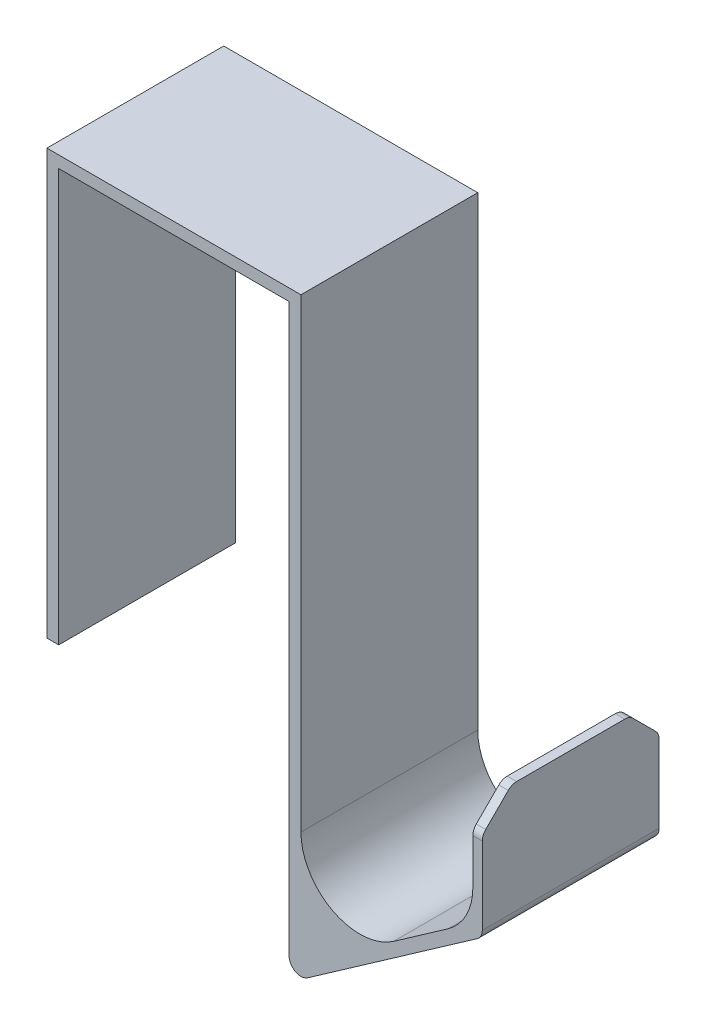
ISO-10303-21;
HEADER;
FILE_DESCRIPTION(('STEP AP214'),'2;1');
FILE_NAME('part.step','',(''),(''),'','','');
FILE_SCHEMA(('AUTOMOTIVE_DESIGN { 1 0 10303 214 1 1 1 1 }'));
ENDSEC;
DATA;
#1=APPLICATION_CONTEXT('core data for automotive mechanical design processes');
#2=APPLICATION_PROTOCOL_DEFINITION('international standard','automotive_design',2000,#1);
#3=PRODUCT_CONTEXT('',#1,'mechanical');
#4=PRODUCT('Part','Part','',(#3));
#5=PRODUCT_RELATED_PRODUCT_CATEGORY('part','',(#4));
#6=PRODUCT_DEFINITION_FORMATION('','',#4);
#7=PRODUCT_DEFINITION_CONTEXT('part definition',#1,'design');
#8=PRODUCT_DEFINITION('design','',#6,#7);
#9=PRODUCT_DEFINITION_SHAPE('','',#8);
#10=(LENGTH_UNIT() NAMED_UNIT(*) SI_UNIT(.MILLI.,.METRE.));
#11=(NAMED_UNIT(*) PLANE_ANGLE_UNIT() SI_UNIT($,.RADIAN.));
#12=(NAMED_UNIT(*) SI_UNIT($,.STERADIAN.) SOLID_ANGLE_UNIT());
#13=UNCERTAINTY_MEASURE_WITH_UNIT(LENGTH_MEASURE(1.E-05),#10,'distance_accuracy_value','');
#14=(GEOMETRIC_REPRESENTATION_CONTEXT(3) GLOBAL_UNCERTAINTY_ASSIGNED_CONTEXT((#13)) GLOBAL_UNIT_ASSIGNED_CONTEXT((#10,
#11,#12)) REPRESENTATION_CONTEXT('',''));
#15=CARTESIAN_POINT('',(0.,0.,0.));
#16=DIRECTION('',(0.,0.,1.));
#17=DIRECTION('',(1.,0.,0.));
#18=AXIS2_PLACEMENT_3D('',#15,#16,#17);
#19=CARTESIAN_POINT('',(-21.55,43.689057372,30.));
#20=DIRECTION('',(0.,1.,0.));
#21=DIRECTION('',(-1.,0.,0.));
#22=AXIS2_PLACEMENT_3D('',#19,#20,#21);
#23=PLANE('',#22);
#24=DIRECTION('',(1.,0.,0.));
#25=VECTOR('',#24,1.);
#26=CARTESIAN_POINT('',(-21.55,43.689057372,0.));
#27=LINE('',#26,#25);
#28=CARTESIAN_POINT('',(-21.55,43.689057372,0.));
#29=VERTEX_POINT('',#28);
#30=CARTESIAN_POINT('',(-19.55,43.689057372,0.));
#31=VERTEX_POINT('',#30);
#32=EDGE_CURVE('E207',#29,#31,#27,.T.);
#33=ORIENTED_EDGE('',*,*,#32,.T.);
#34=DIRECTION('',(0.,0.,-1.));
#35=VECTOR('',#34,1.);
#36=CARTESIAN_POINT('',(-19.55,43.689057372,30.));
#37=LINE('',#36,#35);
#38=CARTESIAN_POINT('',(-19.55,43.689057372,30.));
#39=VERTEX_POINT('',#38);
#40=EDGE_CURVE('E187',#39,#31,#37,.T.);
#41=ORIENTED_EDGE('',*,*,#40,.F.);
#42=DIRECTION('',(1.,0.,0.));
#43=VECTOR('',#42,1.);
#44=CARTESIAN_POINT('',(-21.55,43.689057372,30.));
#45=LINE('',#44,#43);
#46=CARTESIAN_POINT('',(-21.55,43.689057372,30.));
#47=VERTEX_POINT('',#46);
#48=EDGE_CURVE('E194',#47,#39,#45,.T.);
#49=ORIENTED_EDGE('',*,*,#48,.F.);
#50=DIRECTION('',(0.,0.,-1.));
#51=VECTOR('',#50,1.);
#52=CARTESIAN_POINT('',(-21.55,43.689057372,30.));
#53=LINE('',#52,#51);
#54=EDGE_CURVE('E332',#47,#29,#53,.T.);
#55=ORIENTED_EDGE('',*,*,#54,.T.);
#56=EDGE_LOOP('',(#33,#41,#49,#55));
#57=FACE_BOUND('',#56,.T.);
#58=ADVANCED_FACE('F35',(#57),#23,.F.);
#59=CARTESIAN_POINT('',(-19.55,43.689057372,30.));
#60=DIRECTION('',(-1.,0.,0.));
#61=DIRECTION('',(0.,0.,1.));
#62=AXIS2_PLACEMENT_3D('',#59,#60,#61);
#63=PLANE('',#62);
#64=DIRECTION('',(0.,1.,0.));
#65=VECTOR('',#64,1.);
#66=CARTESIAN_POINT('',(-19.55,43.689057372,0.));
#67=LINE('',#66,#65);
#68=CARTESIAN_POINT('',(-19.55,113.689057372,0.));
#69=VERTEX_POINT('',#68);
#70=EDGE_CURVE('E354',#31,#69,#67,.T.);
#71=ORIENTED_EDGE('',*,*,#70,.T.);
#72=DIRECTION('',(0.,0.,-1.));
#73=VECTOR('',#72,1.);
#74=CARTESIAN_POINT('',(-19.55,113.689057372,30.));
#75=LINE('',#74,#73);
#76=CARTESIAN_POINT('',(-19.55,113.689057372,30.));
#77=VERTEX_POINT('',#76);
#78=EDGE_CURVE('E190',#77,#69,#75,.T.);
#79=ORIENTED_EDGE('',*,*,#78,.F.);
#80=DIRECTION('',(0.,1.,0.));
#81=VECTOR('',#80,1.);
#82=CARTESIAN_POINT('',(-19.55,43.689057372,30.));
#83=LINE('',#82,#81);
#84=EDGE_CURVE('E183',#39,#77,#83,.T.);
#85=ORIENTED_EDGE('',*,*,#84,.F.);
#86=ORIENTED_EDGE('',*,*,#40,.T.);
#87=EDGE_LOOP('',(#71,#79,#85,#86));
#88=FACE_BOUND('',#87,.T.);
#89=ADVANCED_FACE('F185',(#88),#63,.F.);
#90=CARTESIAN_POINT('',(-19.55,113.689057372,30.));
#91=DIRECTION('',(0.,1.,0.));
#92=DIRECTION('',(0.,0.,1.));
#93=AXIS2_PLACEMENT_3D('',#90,#91,#92);
#94=PLANE('',#93);
#95=DIRECTION('',(1.,0.,0.));
#96=VECTOR('',#95,1.);
#97=CARTESIAN_POINT('',(-19.55,113.689057372,0.));
#98=LINE('',#97,#96);
#99=CARTESIAN_POINT('',(19.55,113.689057372,0.));
#100=VERTEX_POINT('',#99);
#101=EDGE_CURVE('E353',#69,#100,#98,.T.);
#102=ORIENTED_EDGE('',*,*,#101,.T.);
#103=DIRECTION('',(0.,0.,-1.));
#104=VECTOR('',#103,1.);
#105=CARTESIAN_POINT('',(19.55,113.689057372,30.));
#106=LINE('',#105,#104);
#107=CARTESIAN_POINT('',(19.55,113.689057372,30.));
#108=VERTEX_POINT('',#107);
#109=EDGE_CURVE('E212',#108,#100,#106,.T.);
#110=ORIENTED_EDGE('',*,*,#109,.F.);
#111=DIRECTION('',(1.,0.,0.));
#112=VECTOR('',#111,1.);
#113=CARTESIAN_POINT('',(-19.55,113.689057372,30.));
#114=LINE('',#113,#112);
#115=EDGE_CURVE('E193',#77,#108,#114,.T.);
#116=ORIENTED_EDGE('',*,*,#115,.F.);
#117=ORIENTED_EDGE('',*,*,#78,.T.);
#118=EDGE_LOOP('',(#102,#110,#116,#117));
#119=FACE_BOUND('',#118,.T.);
#120=ADVANCED_FACE('F371',(#119),#94,.F.);
#121=CARTESIAN_POINT('',(19.55,113.689057372,30.));
#122=DIRECTION('',(1.,0.,0.));
#123=DIRECTION('',(0.,0.,-1.));
#124=AXIS2_PLACEMENT_3D('',#121,#122,#123);
#125=PLANE('',#124);
#126=DIRECTION('',(0.,-1.,0.));
#127=VECTOR('',#126,1.);
#128=CARTESIAN_POINT('',(19.55,113.689057372,0.));
#129=LINE('',#128,#127);
#130=CARTESIAN_POINT('',(19.55,17.5310216259423,0.));
#131=VERTEX_POINT('',#130);
#132=EDGE_CURVE('E321',#100,#131,#129,.T.);
#133=ORIENTED_EDGE('',*,*,#132,.T.);
#134=DIRECTION('',(0.,0.,-1.));
#135=VECTOR('',#134,1.);
#136=CARTESIAN_POINT('',(19.55,17.5310216259423,30.));
#137=LINE('',#136,#135);
#138=CARTESIAN_POINT('',(19.55,17.5310216259423,30.));
#139=VERTEX_POINT('',#138);
#140=EDGE_CURVE('E11',#131,#139,#137,.F.);
#141=ORIENTED_EDGE('',*,*,#140,.T.);
#142=DIRECTION('',(0.,-1.,0.));
#143=VECTOR('',#142,1.);
#144=CARTESIAN_POINT('',(19.55,113.689057372,30.));
#145=LINE('',#144,#143);
#146=EDGE_CURVE('E306',#108,#139,#145,.T.);
#147=ORIENTED_EDGE('',*,*,#146,.F.);
#148=ORIENTED_EDGE('',*,*,#109,.T.);
#149=EDGE_LOOP('',(#133,#141,#147,#148));
#150=FACE_BOUND('',#149,.T.);
#151=ADVANCED_FACE('F349',(#150),#125,.F.);
#152=CARTESIAN_POINT('',(19.55,13.689057372,30.));
#153=DIRECTION('',(-0.57357643635105,0.819152044288989,0.));
#154=DIRECTION('',(-0.819152044288989,-0.57357643635105,0.));
#155=AXIS2_PLACEMENT_3D('',#152,#153,#154);
#156=PLANE('',#155);
#157=DIRECTION('',(0.819152044288989,0.57357643635105,0.));
#158=VECTOR('',#157,1.);
#159=CARTESIAN_POINT('',(19.55,13.689057372,0.));
#160=LINE('',#159,#158);
#161=CARTESIAN_POINT('',(22.6971528727021,15.8927175373644,0.));
#162=VERTEX_POINT('',#161);
#163=CARTESIAN_POINT('',(51.4632346442617,36.0349448385675,0.));
#164=VERTEX_POINT('',#163);
#165=EDGE_CURVE('E299',#162,#164,#160,.T.);
#166=ORIENTED_EDGE('',*,*,#165,.T.);
#167=DIRECTION('',(0.,0.,-1.));
#168=VECTOR('',#167,1.);
#169=CARTESIAN_POINT('',(51.4632346442617,36.0349448385675,30.));
#170=LINE('',#169,#168);
#171=CARTESIAN_POINT('',(51.4632346442617,36.0349448385675,30.));
#172=VERTEX_POINT('',#171);
#173=EDGE_CURVE('E43',#164,#172,#170,.F.);
#174=ORIENTED_EDGE('',*,*,#173,.T.);
#175=DIRECTION('',(0.819152044288989,0.57357643635105,0.));
#176=VECTOR('',#175,1.);
#177=CARTESIAN_POINT('',(19.55,13.689057372,30.));
#178=LINE('',#177,#176);
#179=CARTESIAN_POINT('',(22.6971528727021,15.8927175373644,30.));
#180=VERTEX_POINT('',#179);
#181=EDGE_CURVE('E297',#180,#172,#178,.T.);
#182=ORIENTED_EDGE('',*,*,#181,.F.);
#183=DIRECTION('',(0.,0.,-1.));
#184=VECTOR('',#183,1.);
#185=CARTESIAN_POINT('',(22.6971528727021,15.8927175373644,30.));
#186=LINE('',#185,#184);
#187=EDGE_CURVE('E290',#180,#162,#186,.T.);
#188=ORIENTED_EDGE('',*,*,#187,.T.);
#189=EDGE_LOOP('',(#166,#174,#182,#188));
#190=FACE_BOUND('',#189,.T.);
#191=ADVANCED_FACE('F296',(#190),#156,.F.);
#192=CARTESIAN_POINT('',(52.3160817715596,36.632114826042,30.));
#193=DIRECTION('',(-1.,0.,0.));
#194=DIRECTION('',(0.,0.,1.));
#195=AXIS2_PLACEMENT_3D('',#192,#193,#194);
#196=PLANE('',#195);
#197=DIRECTION('',(0.,-0.707106781186546,0.707106781186549));
#198=VECTOR('',#197,1.);
#199=CARTESIAN_POINT('',(52.3160817715596,51.632114826042,30.));
#200=LINE('',#199,#198);
#201=CARTESIAN_POINT('',(52.3160817715596,56.0463283884151,25.5857864376269));
#202=VERTEX_POINT('',#201);
#203=CARTESIAN_POINT('',(52.3160817715596,52.2179012636689,29.4142135623731));
#204=VERTEX_POINT('',#203);
#205=EDGE_CURVE('E239',#202,#204,#200,.T.);
#206=ORIENTED_EDGE('',*,*,#205,.T.);
#207=CARTESIAN_POINT('',(52.3160817715596,50.8036877012958,28.));
#208=DIRECTION('',(-1.,0.,0.));
#209=DIRECTION('',(0.,0.,1.));
#210=AXIS2_PLACEMENT_3D('',#207,#208,#209);
#211=CIRCLE('',#210,2.);
#212=CARTESIAN_POINT('',(52.3160817715596,50.8036877012958,30.));
#213=VERTEX_POINT('',#212);
#214=EDGE_CURVE('E273',#204,#213,#211,.F.);
#215=ORIENTED_EDGE('',*,*,#214,.T.);
#216=DIRECTION('',(0.,1.,0.));
#217=VECTOR('',#216,1.);
#218=CARTESIAN_POINT('',(52.3160817715596,36.632114826042,30.));
#219=LINE('',#218,#217);
#220=CARTESIAN_POINT('',(52.3160817715596,37.6732489271455,30.));
#221=VERTEX_POINT('',#220);
#222=EDGE_CURVE('E305',#221,#213,#219,.T.);
#223=ORIENTED_EDGE('',*,*,#222,.F.);
#224=DIRECTION('',(0.,0.,-1.));
#225=VECTOR('',#224,1.);
#226=CARTESIAN_POINT('',(52.3160817715596,37.6732489271455,30.));
#227=LINE('',#226,#225);
#228=CARTESIAN_POINT('',(52.3160817715596,37.6732489271455,0.));
#229=VERTEX_POINT('',#228);
#230=EDGE_CURVE('E264',#221,#229,#227,.T.);
#231=ORIENTED_EDGE('',*,*,#230,.T.);
#232=DIRECTION('',(0.,1.,0.));
#233=VECTOR('',#232,1.);
#234=CARTESIAN_POINT('',(52.3160817715596,36.632114826042,0.));
#235=LINE('',#234,#233);
#236=CARTESIAN_POINT('',(52.3160817715596,50.8036877012958,0.));
#237=VERTEX_POINT('',#236);
#238=EDGE_CURVE('E313',#229,#237,#235,.T.);
#239=ORIENTED_EDGE('',*,*,#238,.T.);
#240=CARTESIAN_POINT('',(52.3160817715596,50.8036877012958,2.));
#241=DIRECTION('',(-1.,0.,0.));
#242=DIRECTION('',(0.,0.,1.));
#243=AXIS2_PLACEMENT_3D('',#240,#241,#242);
#244=CIRCLE('',#243,2.);
#245=CARTESIAN_POINT('',(52.3160817715596,52.2179012636689,0.5857864376269));
#246=VERTEX_POINT('',#245);
#247=EDGE_CURVE('E271',#237,#246,#244,.F.);
#248=ORIENTED_EDGE('',*,*,#247,.T.);
#249=DIRECTION('',(0.,-0.70710678118655,-0.707106781186545));
#250=VECTOR('',#249,1.);
#251=CARTESIAN_POINT('',(52.3160817715596,56.632114826042,4.99999999999996));
#252=LINE('',#251,#250);
#253=CARTESIAN_POINT('',(52.3160817715596,56.0463283884151,4.41421356237306));
#254=VERTEX_POINT('',#253);
#255=EDGE_CURVE('E242',#246,#254,#252,.F.);
#256=ORIENTED_EDGE('',*,*,#255,.T.);
#257=CARTESIAN_POINT('',(52.3160817715596,54.632114826042,5.82842712474615));
#258=DIRECTION('',(-1.,0.,0.));
#259=DIRECTION('',(0.,0.,1.));
#260=AXIS2_PLACEMENT_3D('',#257,#258,#259);
#261=CIRCLE('',#260,2.);
#262=CARTESIAN_POINT('',(52.3160817715596,56.632114826042,5.82842712474615));
#263=VERTEX_POINT('',#262);
#264=EDGE_CURVE('E269',#254,#263,#261,.F.);
#265=ORIENTED_EDGE('',*,*,#264,.T.);
#266=DIRECTION('',(0.,0.,-1.));
#267=VECTOR('',#266,1.);
#268=CARTESIAN_POINT('',(52.3160817715596,56.632114826042,30.));
#269=LINE('',#268,#267);
#270=CARTESIAN_POINT('',(52.3160817715596,56.632114826042,24.1715728752538));
#271=VERTEX_POINT('',#270);
#272=EDGE_CURVE('E343',#271,#263,#269,.T.);
#273=ORIENTED_EDGE('',*,*,#272,.F.);
#274=CARTESIAN_POINT('',(52.3160817715596,54.632114826042,24.1715728752538));
#275=DIRECTION('',(-1.,0.,0.));
#276=DIRECTION('',(0.,0.,1.));
#277=AXIS2_PLACEMENT_3D('',#274,#275,#276);
#278=CIRCLE('',#277,2.);
#279=EDGE_CURVE('E267',#271,#202,#278,.F.);
#280=ORIENTED_EDGE('',*,*,#279,.T.);
#281=EDGE_LOOP('',(#206,#215,#223,#231,#239,#248,#256,#265,#273,#280));
#282=FACE_BOUND('',#281,.T.);
#283=ADVANCED_FACE('F312',(#282),#196,.F.);
#284=CARTESIAN_POINT('',(50.7160817715596,56.632114826042,30.));
#285=DIRECTION('',(0.,-1.,0.));
#286=DIRECTION('',(0.,0.,-1.));
#287=AXIS2_PLACEMENT_3D('',#284,#285,#286);
#288=PLANE('',#287);
#289=ORIENTED_EDGE('',*,*,#272,.T.);
#290=DIRECTION('',(1.,0.,0.));
#291=VECTOR('',#290,1.);
#292=CARTESIAN_POINT('',(50.7160817715596,56.632114826042,5.82842712474615));
#293=LINE('',#292,#291);
#294=CARTESIAN_POINT('',(50.7160817715596,56.632114826042,5.82842712474615));
#295=VERTEX_POINT('',#294);
#296=EDGE_CURVE('E287',#263,#295,#293,.F.);
#297=ORIENTED_EDGE('',*,*,#296,.T.);
#298=DIRECTION('',(0.,0.,-1.));
#299=VECTOR('',#298,1.);
#300=CARTESIAN_POINT('',(50.7160817715596,56.632114826042,30.));
#301=LINE('',#300,#299);
#302=CARTESIAN_POINT('',(50.7160817715596,56.632114826042,24.1715728752538));
#303=VERTEX_POINT('',#302);
#304=EDGE_CURVE('E340',#303,#295,#301,.T.);
#305=ORIENTED_EDGE('',*,*,#304,.F.);
#306=DIRECTION('',(1.,0.,0.));
#307=VECTOR('',#306,1.);
#308=CARTESIAN_POINT('',(52.3160817715596,56.632114826042,24.1715728752538));
#309=LINE('',#308,#307);
#310=EDGE_CURVE('E284',#303,#271,#309,.T.);
#311=ORIENTED_EDGE('',*,*,#310,.T.);
#312=EDGE_LOOP('',(#289,#297,#305,#311));
#313=FACE_BOUND('',#312,.T.);
#314=ADVANCED_FACE('F501',(#313),#288,.F.);
#315=CARTESIAN_POINT('',(50.7160817715596,37.9533319424294,30.));
#316=DIRECTION('',(1.,0.,0.));
#317=DIRECTION('',(0.,0.,-1.));
#318=AXIS2_PLACEMENT_3D('',#315,#316,#317);
#319=PLANE('',#318);
#320=DIRECTION('',(0.,-1.,0.));
#321=VECTOR('',#320,1.);
#322=CARTESIAN_POINT('',(50.7160817715596,37.9533319424294,30.));
#323=LINE('',#322,#321);
#324=CARTESIAN_POINT('',(50.7160817715596,50.8036877012958,30.));
#325=VERTEX_POINT('',#324);
#326=CARTESIAN_POINT('',(50.7160817715596,43.1590024479468,30.));
#327=VERTEX_POINT('',#326);
#328=EDGE_CURVE('E367',#325,#327,#323,.T.);
#329=ORIENTED_EDGE('',*,*,#328,.F.);
#330=CARTESIAN_POINT('',(50.7160817715596,50.8036877012958,28.));
#331=DIRECTION('',(1.,0.,0.));
#332=DIRECTION('',(0.,0.,-1.));
#333=AXIS2_PLACEMENT_3D('',#330,#331,#332);
#334=CIRCLE('',#333,2.);
#335=CARTESIAN_POINT('',(50.7160817715596,52.2179012636689,29.4142135623731));
#336=VERTEX_POINT('',#335);
#337=EDGE_CURVE('E258',#325,#336,#334,.F.);
#338=ORIENTED_EDGE('',*,*,#337,.T.);
#339=DIRECTION('',(0.,0.707106781186546,-0.707106781186549));
#340=VECTOR('',#339,1.);
#341=CARTESIAN_POINT('',(50.7160817715596,51.632114826042,30.));
#342=LINE('',#341,#340);
#343=CARTESIAN_POINT('',(50.7160817715596,56.0463283884151,25.5857864376269));
#344=VERTEX_POINT('',#343);
#345=EDGE_CURVE('E233',#336,#344,#342,.T.);
#346=ORIENTED_EDGE('',*,*,#345,.T.);
#347=CARTESIAN_POINT('',(50.7160817715596,54.632114826042,24.1715728752538));
#348=DIRECTION('',(1.,0.,0.));
#349=DIRECTION('',(0.,0.,-1.));
#350=AXIS2_PLACEMENT_3D('',#347,#348,#349);
#351=CIRCLE('',#350,2.);
#352=EDGE_CURVE('E252',#344,#303,#351,.F.);
#353=ORIENTED_EDGE('',*,*,#352,.T.);
#354=ORIENTED_EDGE('',*,*,#304,.T.);
#355=CARTESIAN_POINT('',(50.7160817715596,54.632114826042,5.82842712474615));
#356=DIRECTION('',(1.,0.,0.));
#357=DIRECTION('',(0.,0.,-1.));
#358=AXIS2_PLACEMENT_3D('',#355,#356,#357);
#359=CIRCLE('',#358,2.);
#360=CARTESIAN_POINT('',(50.7160817715596,56.0463283884151,4.41421356237306));
#361=VERTEX_POINT('',#360);
#362=EDGE_CURVE('E254',#295,#361,#359,.F.);
#363=ORIENTED_EDGE('',*,*,#362,.T.);
#364=DIRECTION('',(0.,0.70710678118655,0.707106781186545));
#365=VECTOR('',#364,1.);
#366=CARTESIAN_POINT('',(50.7160817715596,56.632114826042,4.99999999999996));
#367=LINE('',#366,#365);
#368=CARTESIAN_POINT('',(50.7160817715596,52.2179012636689,0.5857864376269));
#369=VERTEX_POINT('',#368);
#370=EDGE_CURVE('E236',#361,#369,#367,.F.);
#371=ORIENTED_EDGE('',*,*,#370,.T.);
#372=CARTESIAN_POINT('',(50.7160817715596,50.8036877012958,2.));
#373=DIRECTION('',(1.,0.,0.));
#374=DIRECTION('',(0.,0.,-1.));
#375=AXIS2_PLACEMENT_3D('',#372,#373,#374);
#376=CIRCLE('',#375,2.);
#377=CARTESIAN_POINT('',(50.7160817715596,50.8036877012958,0.));
#378=VERTEX_POINT('',#377);
#379=EDGE_CURVE('E256',#369,#378,#376,.F.);
#380=ORIENTED_EDGE('',*,*,#379,.T.);
#381=DIRECTION('',(0.,-1.,0.));
#382=VECTOR('',#381,1.);
#383=CARTESIAN_POINT('',(50.7160817715596,37.9533319424294,0.));
#384=LINE('',#383,#382);
#385=CARTESIAN_POINT('',(50.7160817715596,43.1590024479468,0.));
#386=VERTEX_POINT('',#385);
#387=EDGE_CURVE('E317',#378,#386,#384,.T.);
#388=ORIENTED_EDGE('',*,*,#387,.T.);
#389=DIRECTION('',(0.,0.,-1.));
#390=VECTOR('',#389,1.);
#391=CARTESIAN_POINT('',(50.7160817715596,43.1590024479468,30.));
#392=LINE('',#391,#390);
#393=EDGE_CURVE('E218',#386,#327,#392,.F.);
#394=ORIENTED_EDGE('',*,*,#393,.T.);
#395=EDGE_LOOP('',(#329,#338,#346,#353,#354,#363,#371,#380,#388,#394));
#396=FACE_BOUND('',#395,.T.);
#397=ADVANCED_FACE('F495',(#396),#319,.F.);
#398=CARTESIAN_POINT('',(21.55,17.5310216259423,30.));
#399=DIRECTION('',(0.57357643635105,-0.819152044288989,0.));
#400=DIRECTION('',(0.819152044288989,0.57357643635105,0.));
#401=AXIS2_PLACEMENT_3D('',#398,#399,#400);
#402=PLANE('',#401);
#403=DIRECTION('',(-0.819152044288989,-0.57357643635105,0.));
#404=VECTOR('',#403,1.);
#405=CARTESIAN_POINT('',(21.55,17.5310216259423,30.));
#406=LINE('',#405,#404);
#407=CARTESIAN_POINT('',(46.4518461350701,34.9674820050569,30.));
#408=VERTEX_POINT('',#407);
#409=CARTESIAN_POINT('',(37.2857643635105,28.5493224527642,30.));
#410=VERTEX_POINT('',#409);
#411=EDGE_CURVE('E364',#408,#410,#406,.T.);
#412=ORIENTED_EDGE('',*,*,#411,.F.);
#413=DIRECTION('',(0.,0.,-1.));
#414=VECTOR('',#413,1.);
#415=CARTESIAN_POINT('',(46.4518461350701,34.9674820050569,0.));
#416=LINE('',#415,#414);
#417=CARTESIAN_POINT('',(46.4518461350701,34.9674820050569,0.));
#418=VERTEX_POINT('',#417);
#419=EDGE_CURVE('E210',#408,#418,#416,.T.);
#420=ORIENTED_EDGE('',*,*,#419,.T.);
#421=DIRECTION('',(-0.819152044288989,-0.57357643635105,0.));
#422=VECTOR('',#421,1.);
#423=CARTESIAN_POINT('',(21.55,17.5310216259423,0.));
#424=LINE('',#423,#422);
#425=CARTESIAN_POINT('',(37.2857643635105,28.5493224527642,0.));
#426=VERTEX_POINT('',#425);
#427=EDGE_CURVE('E319',#418,#426,#424,.T.);
#428=ORIENTED_EDGE('',*,*,#427,.T.);
#429=DIRECTION('',(0.,0.,-1.));
#430=VECTOR('',#429,1.);
#431=CARTESIAN_POINT('',(37.2857643635105,28.5493224527642,30.));
#432=LINE('',#431,#430);
#433=EDGE_CURVE('E208',#426,#410,#432,.F.);
#434=ORIENTED_EDGE('',*,*,#433,.T.);
#435=EDGE_LOOP('',(#412,#420,#428,#434));
#436=FACE_BOUND('',#435,.T.);
#437=ADVANCED_FACE('F500',(#436),#402,.F.);
#438=CARTESIAN_POINT('',(21.55,115.689057372,30.));
#439=DIRECTION('',(-1.,0.,0.));
#440=DIRECTION('',(0.,-1.,0.));
#441=AXIS2_PLACEMENT_3D('',#438,#439,#440);
#442=PLANE('',#441);
#443=DIRECTION('',(0.,1.,0.));
#444=VECTOR('',#443,1.);
#445=CARTESIAN_POINT('',(21.55,115.689057372,30.));
#446=LINE('',#445,#444);
#447=CARTESIAN_POINT('',(21.55,36.7408428956541,30.));
#448=VERTEX_POINT('',#447);
#449=CARTESIAN_POINT('',(21.55,115.689057372,30.));
#450=VERTEX_POINT('',#449);
#451=EDGE_CURVE('E362',#448,#450,#446,.T.);
#452=ORIENTED_EDGE('',*,*,#451,.F.);
#453=DIRECTION('',(0.,0.,-1.));
#454=VECTOR('',#453,1.);
#455=CARTESIAN_POINT('',(21.55,36.7408428956541,0.));
#456=LINE('',#455,#454);
#457=CARTESIAN_POINT('',(21.55,36.7408428956541,0.));
#458=VERTEX_POINT('',#457);
#459=EDGE_CURVE('E221',#448,#458,#456,.T.);
#460=ORIENTED_EDGE('',*,*,#459,.T.);
#461=DIRECTION('',(0.,1.,0.));
#462=VECTOR('',#461,1.);
#463=CARTESIAN_POINT('',(21.55,115.689057372,0.));
#464=LINE('',#463,#462);
#465=CARTESIAN_POINT('',(21.55,115.689057372,0.));
#466=VERTEX_POINT('',#465);
#467=EDGE_CURVE('E327',#458,#466,#464,.T.);
#468=ORIENTED_EDGE('',*,*,#467,.T.);
#469=DIRECTION('',(0.,0.,-1.));
#470=VECTOR('',#469,1.);
#471=CARTESIAN_POINT('',(21.55,115.689057372,30.));
#472=LINE('',#471,#470);
#473=EDGE_CURVE('E337',#450,#466,#472,.T.);
#474=ORIENTED_EDGE('',*,*,#473,.F.);
#475=EDGE_LOOP('',(#452,#460,#468,#474));
#476=FACE_BOUND('',#475,.T.);
#477=ADVANCED_FACE('F551',(#476),#442,.F.);
#478=CARTESIAN_POINT('',(-21.55,115.689057372,30.));
#479=DIRECTION('',(0.,-1.,0.));
#480=DIRECTION('',(1.,0.,0.));
#481=AXIS2_PLACEMENT_3D('',#478,#479,#480);
#482=PLANE('',#481);
#483=DIRECTION('',(-1.,0.,0.));
#484=VECTOR('',#483,1.);
#485=CARTESIAN_POINT('',(-21.55,115.689057372,0.));
#486=LINE('',#485,#484);
#487=CARTESIAN_POINT('',(-21.55,115.689057372,0.));
#488=VERTEX_POINT('',#487);
#489=EDGE_CURVE('E329',#466,#488,#486,.T.);
#490=ORIENTED_EDGE('',*,*,#489,.T.);
#491=DIRECTION('',(0.,0.,-1.));
#492=VECTOR('',#491,1.);
#493=CARTESIAN_POINT('',(-21.55,115.689057372,30.));
#494=LINE('',#493,#492);
#495=CARTESIAN_POINT('',(-21.55,115.689057372,30.));
#496=VERTEX_POINT('',#495);
#497=EDGE_CURVE('E334',#496,#488,#494,.T.);
#498=ORIENTED_EDGE('',*,*,#497,.F.);
#499=DIRECTION('',(-1.,0.,0.));
#500=VECTOR('',#499,1.);
#501=CARTESIAN_POINT('',(-21.55,115.689057372,30.));
#502=LINE('',#501,#500);
#503=EDGE_CURVE('E360',#450,#496,#502,.T.);
#504=ORIENTED_EDGE('',*,*,#503,.F.);
#505=ORIENTED_EDGE('',*,*,#473,.T.);
#506=EDGE_LOOP('',(#490,#498,#504,#505));
#507=FACE_BOUND('',#506,.T.);
#508=ADVANCED_FACE('F556',(#507),#482,.F.);
#509=CARTESIAN_POINT('',(-21.55,43.689057372,30.));
#510=DIRECTION('',(1.,0.,0.));
#511=DIRECTION('',(0.,0.,-1.));
#512=AXIS2_PLACEMENT_3D('',#509,#510,#511);
#513=PLANE('',#512);
#514=DIRECTION('',(0.,-1.,0.));
#515=VECTOR('',#514,1.);
#516=CARTESIAN_POINT('',(-21.55,43.689057372,0.));
#517=LINE('',#516,#515);
#518=EDGE_CURVE('E204',#488,#29,#517,.T.);
#519=ORIENTED_EDGE('',*,*,#518,.T.);
#520=ORIENTED_EDGE('',*,*,#54,.F.);
#521=DIRECTION('',(0.,-1.,0.));
#522=VECTOR('',#521,1.);
#523=CARTESIAN_POINT('',(-21.55,43.689057372,30.));
#524=LINE('',#523,#522);
#525=EDGE_CURVE('E200',#496,#47,#524,.T.);
#526=ORIENTED_EDGE('',*,*,#525,.F.);
#527=ORIENTED_EDGE('',*,*,#497,.T.);
#528=EDGE_LOOP('',(#519,#520,#526,#527));
#529=FACE_BOUND('',#528,.T.);
#530=ADVANCED_FACE('F488',(#529),#513,.F.);
#531=CARTESIAN_POINT('',(0.,0.,30.));
#532=DIRECTION('',(0.,0.,1.));
#533=DIRECTION('',(1.,0.,0.));
#534=AXIS2_PLACEMENT_3D('',#531,#532,#533);
#535=PLANE('',#534);
#536=ORIENTED_EDGE('',*,*,#222,.T.);
#537=DIRECTION('',(-1.,0.,0.));
#538=VECTOR('',#537,1.);
#539=CARTESIAN_POINT('',(0.,50.8036877012958,30.));
#540=LINE('',#539,#538);
#541=EDGE_CURVE('E249',#213,#325,#540,.T.);
#542=ORIENTED_EDGE('',*,*,#541,.T.);
#543=ORIENTED_EDGE('',*,*,#328,.T.);
#544=CARTESIAN_POINT('',(40.7160817715596,43.1590024479468,30.));
#545=DIRECTION('',(0.,0.,1.));
#546=DIRECTION('',(1.,0.,0.));
#547=AXIS2_PLACEMENT_3D('',#544,#545,#546);
#548=CIRCLE('',#547,10.);
#549=EDGE_CURVE('E227',#327,#408,#548,.F.);
#550=ORIENTED_EDGE('',*,*,#549,.T.);
#551=ORIENTED_EDGE('',*,*,#411,.T.);
#552=CARTESIAN_POINT('',(31.55,36.7408428956541,30.));
#553=DIRECTION('',(0.,0.,1.));
#554=DIRECTION('',(1.,0.,0.));
#555=AXIS2_PLACEMENT_3D('',#552,#553,#554);
#556=CIRCLE('',#555,10.);
#557=EDGE_CURVE('E231',#410,#448,#556,.F.);
#558=ORIENTED_EDGE('',*,*,#557,.T.);
#559=ORIENTED_EDGE('',*,*,#451,.T.);
#560=ORIENTED_EDGE('',*,*,#503,.T.);
#561=ORIENTED_EDGE('',*,*,#525,.T.);
#562=ORIENTED_EDGE('',*,*,#48,.T.);
#563=ORIENTED_EDGE('',*,*,#84,.T.);
#564=ORIENTED_EDGE('',*,*,#115,.T.);
#565=ORIENTED_EDGE('',*,*,#146,.T.);
#566=CARTESIAN_POINT('',(21.55,17.5310216259423,30.));
#567=DIRECTION('',(0.,0.,1.));
#568=DIRECTION('',(1.,0.,0.));
#569=AXIS2_PLACEMENT_3D('',#566,#567,#568);
#570=CIRCLE('',#569,2.);
#571=EDGE_CURVE('E245',#139,#180,#570,.T.);
#572=ORIENTED_EDGE('',*,*,#571,.T.);
#573=ORIENTED_EDGE('',*,*,#181,.T.);
#574=CARTESIAN_POINT('',(50.3160817715596,37.6732489271455,30.));
#575=DIRECTION('',(0.,0.,1.));
#576=DIRECTION('',(1.,0.,0.));
#577=AXIS2_PLACEMENT_3D('',#574,#575,#576);
#578=CIRCLE('',#577,2.);
#579=EDGE_CURVE('E247',#172,#221,#578,.T.);
#580=ORIENTED_EDGE('',*,*,#579,.T.);
#581=EDGE_LOOP('',(#536,#542,#543,#550,#551,#558,#559,#560,#561,#562,#563,#564,#565,#572,#573,#580));
#582=FACE_BOUND('',#581,.T.);
#583=ADVANCED_FACE('F198',(#582),#535,.T.);
#584=CARTESIAN_POINT('',(0.,0.,0.));
#585=DIRECTION('',(0.,0.,1.));
#586=DIRECTION('',(1.,0.,0.));
#587=AXIS2_PLACEMENT_3D('',#584,#585,#586);
#588=PLANE('',#587);
#589=ORIENTED_EDGE('',*,*,#387,.F.);
#590=DIRECTION('',(-1.,0.,0.));
#591=VECTOR('',#590,1.);
#592=CARTESIAN_POINT('',(52.3160817715596,50.8036877012958,0.));
#593=LINE('',#592,#591);
#594=EDGE_CURVE('E277',#378,#237,#593,.F.);
#595=ORIENTED_EDGE('',*,*,#594,.T.);
#596=ORIENTED_EDGE('',*,*,#238,.F.);
#597=CARTESIAN_POINT('',(50.3160817715596,37.6732489271455,0.));
#598=DIRECTION('',(0.,0.,1.));
#599=DIRECTION('',(1.,0.,0.));
#600=AXIS2_PLACEMENT_3D('',#597,#598,#599);
#601=CIRCLE('',#600,2.);
#602=EDGE_CURVE('E56',#229,#164,#601,.F.);
#603=ORIENTED_EDGE('',*,*,#602,.T.);
#604=ORIENTED_EDGE('',*,*,#165,.F.);
#605=CARTESIAN_POINT('',(21.55,17.5310216259423,0.));
#606=DIRECTION('',(0.,0.,1.));
#607=DIRECTION('',(1.,0.,0.));
#608=AXIS2_PLACEMENT_3D('',#605,#606,#607);
#609=CIRCLE('',#608,2.);
#610=EDGE_CURVE('E50',#162,#131,#609,.F.);
#611=ORIENTED_EDGE('',*,*,#610,.T.);
#612=ORIENTED_EDGE('',*,*,#132,.F.);
#613=ORIENTED_EDGE('',*,*,#101,.F.);
#614=ORIENTED_EDGE('',*,*,#70,.F.);
#615=ORIENTED_EDGE('',*,*,#32,.F.);
#616=ORIENTED_EDGE('',*,*,#518,.F.);
#617=ORIENTED_EDGE('',*,*,#489,.F.);
#618=ORIENTED_EDGE('',*,*,#467,.F.);
#619=CARTESIAN_POINT('',(31.55,36.7408428956541,0.));
#620=DIRECTION('',(0.,0.,1.));
#621=DIRECTION('',(1.,0.,0.));
#622=AXIS2_PLACEMENT_3D('',#619,#620,#621);
#623=CIRCLE('',#622,10.);
#624=EDGE_CURVE('E229',#458,#426,#623,.T.);
#625=ORIENTED_EDGE('',*,*,#624,.T.);
#626=ORIENTED_EDGE('',*,*,#427,.F.);
#627=CARTESIAN_POINT('',(40.7160817715596,43.1590024479468,0.));
#628=DIRECTION('',(0.,0.,1.));
#629=DIRECTION('',(1.,0.,0.));
#630=AXIS2_PLACEMENT_3D('',#627,#628,#629);
#631=CIRCLE('',#630,10.);
#632=EDGE_CURVE('E224',#418,#386,#631,.T.);
#633=ORIENTED_EDGE('',*,*,#632,.T.);
#634=EDGE_LOOP('',(#589,#595,#596,#603,#604,#611,#612,#613,#614,#615,#616,#617,#618,#625,#626,#633));
#635=FACE_BOUND('',#634,.T.);
#636=ADVANCED_FACE('F315',(#635),#588,.F.);
#637=CARTESIAN_POINT('',(40.7160817715596,43.1590024479468,30.));
#638=DIRECTION('',(0.,0.,1.));
#639=DIRECTION('',(1.,0.,0.));
#640=AXIS2_PLACEMENT_3D('',#637,#638,#639);
#641=CYLINDRICAL_SURFACE('',#640,10.);
#642=ORIENTED_EDGE('',*,*,#549,.F.);
#643=ORIENTED_EDGE('',*,*,#393,.F.);
#644=ORIENTED_EDGE('',*,*,#632,.F.);
#645=ORIENTED_EDGE('',*,*,#419,.F.);
#646=EDGE_LOOP('',(#642,#643,#644,#645));
#647=FACE_BOUND('',#646,.T.);
#648=ADVANCED_FACE('F385',(#647),#641,.F.);
#649=CARTESIAN_POINT('',(31.55,36.7408428956541,30.));
#650=DIRECTION('',(0.,0.,1.));
#651=DIRECTION('',(1.,0.,0.));
#652=AXIS2_PLACEMENT_3D('',#649,#650,#651);
#653=CYLINDRICAL_SURFACE('',#652,10.);
#654=ORIENTED_EDGE('',*,*,#557,.F.);
#655=ORIENTED_EDGE('',*,*,#433,.F.);
#656=ORIENTED_EDGE('',*,*,#624,.F.);
#657=ORIENTED_EDGE('',*,*,#459,.F.);
#658=EDGE_LOOP('',(#654,#655,#656,#657));
#659=FACE_BOUND('',#658,.T.);
#660=ADVANCED_FACE('F388',(#659),#653,.F.);
#661=CARTESIAN_POINT('',(50.7160817715596,56.632114826042,4.99999999999996));
#662=DIRECTION('',(0.,-0.707106781186545,0.70710678118655));
#663=DIRECTION('',(-1.,0.,0.));
#664=AXIS2_PLACEMENT_3D('',#661,#662,#663);
#665=PLANE('',#664);
#666=ORIENTED_EDGE('',*,*,#255,.F.);
#667=DIRECTION('',(1.,0.,0.));
#668=VECTOR('',#667,1.);
#669=CARTESIAN_POINT('',(50.7160817715596,52.2179012636689,0.585786437626899));
#670=LINE('',#669,#668);
#671=EDGE_CURVE('E282',#246,#369,#670,.F.);
#672=ORIENTED_EDGE('',*,*,#671,.T.);
#673=ORIENTED_EDGE('',*,*,#370,.F.);
#674=DIRECTION('',(-1.,0.,0.));
#675=VECTOR('',#674,1.);
#676=CARTESIAN_POINT('',(52.3160817715596,56.0463283884151,4.41421356237305));
#677=LINE('',#676,#675);
#678=EDGE_CURVE('E280',#361,#254,#677,.F.);
#679=ORIENTED_EDGE('',*,*,#678,.T.);
#680=EDGE_LOOP('',(#666,#672,#673,#679));
#681=FACE_BOUND('',#680,.T.);
#682=ADVANCED_FACE('F392',(#681),#665,.F.);
#683=CARTESIAN_POINT('',(0.,51.632114826042,30.));
#684=DIRECTION('',(0.,0.707106781186549,0.707106781186545));
#685=DIRECTION('',(1.,0.,0.));
#686=AXIS2_PLACEMENT_3D('',#683,#684,#685);
#687=PLANE('',#686);
#688=ORIENTED_EDGE('',*,*,#345,.F.);
#689=DIRECTION('',(-1.,0.,0.));
#690=VECTOR('',#689,1.);
#691=CARTESIAN_POINT('',(0.,52.2179012636689,29.4142135623731));
#692=LINE('',#691,#690);
#693=EDGE_CURVE('E262',#336,#204,#692,.F.);
#694=ORIENTED_EDGE('',*,*,#693,.T.);
#695=ORIENTED_EDGE('',*,*,#205,.F.);
#696=DIRECTION('',(1.,0.,0.));
#697=VECTOR('',#696,1.);
#698=CARTESIAN_POINT('',(50.7160817715596,56.0463283884151,25.5857864376269));
#699=LINE('',#698,#697);
#700=EDGE_CURVE('E260',#202,#344,#699,.F.);
#701=ORIENTED_EDGE('',*,*,#700,.T.);
#702=EDGE_LOOP('',(#688,#694,#695,#701));
#703=FACE_BOUND('',#702,.T.);
#704=ADVANCED_FACE('F400',(#703),#687,.T.);
#705=CARTESIAN_POINT('',(0.,50.8036877012958,28.));
#706=DIRECTION('',(-1.,0.,0.));
#707=DIRECTION('',(0.,0.,1.));
#708=AXIS2_PLACEMENT_3D('',#705,#706,#707);
#709=CYLINDRICAL_SURFACE('',#708,2.);
#710=ORIENTED_EDGE('',*,*,#214,.F.);
#711=ORIENTED_EDGE('',*,*,#693,.F.);
#712=ORIENTED_EDGE('',*,*,#337,.F.);
#713=ORIENTED_EDGE('',*,*,#541,.F.);
#714=EDGE_LOOP('',(#710,#711,#712,#713));
#715=FACE_BOUND('',#714,.T.);
#716=ADVANCED_FACE('F406',(#715),#709,.T.);
#717=CARTESIAN_POINT('',(0.,50.8036877012958,2.));
#718=DIRECTION('',(1.,0.,0.));
#719=DIRECTION('',(0.,0.,-1.));
#720=AXIS2_PLACEMENT_3D('',#717,#718,#719);
#721=CYLINDRICAL_SURFACE('',#720,2.);
#722=ORIENTED_EDGE('',*,*,#379,.F.);
#723=ORIENTED_EDGE('',*,*,#671,.F.);
#724=ORIENTED_EDGE('',*,*,#247,.F.);
#725=ORIENTED_EDGE('',*,*,#594,.F.);
#726=EDGE_LOOP('',(#722,#723,#724,#725));
#727=FACE_BOUND('',#726,.T.);
#728=ADVANCED_FACE('F410',(#727),#721,.T.);
#729=CARTESIAN_POINT('',(50.7160817715596,54.632114826042,5.82842712474615));
#730=DIRECTION('',(-1.,0.,0.));
#731=DIRECTION('',(0.,0.,1.));
#732=AXIS2_PLACEMENT_3D('',#729,#730,#731);
#733=CYLINDRICAL_SURFACE('',#732,2.);
#734=ORIENTED_EDGE('',*,*,#264,.F.);
#735=ORIENTED_EDGE('',*,*,#678,.F.);
#736=ORIENTED_EDGE('',*,*,#362,.F.);
#737=ORIENTED_EDGE('',*,*,#296,.F.);
#738=EDGE_LOOP('',(#734,#735,#736,#737));
#739=FACE_BOUND('',#738,.T.);
#740=ADVANCED_FACE('F414',(#739),#733,.T.);
#741=CARTESIAN_POINT('',(50.7160817715596,54.632114826042,24.1715728752538));
#742=DIRECTION('',(-1.,0.,0.));
#743=DIRECTION('',(0.,0.,1.));
#744=AXIS2_PLACEMENT_3D('',#741,#742,#743);
#745=CYLINDRICAL_SURFACE('',#744,2.);
#746=ORIENTED_EDGE('',*,*,#352,.F.);
#747=ORIENTED_EDGE('',*,*,#700,.F.);
#748=ORIENTED_EDGE('',*,*,#279,.F.);
#749=ORIENTED_EDGE('',*,*,#310,.F.);
#750=EDGE_LOOP('',(#746,#747,#748,#749));
#751=FACE_BOUND('',#750,.T.);
#752=ADVANCED_FACE('F418',(#751),#745,.T.);
#753=CARTESIAN_POINT('',(50.3160817715596,37.6732489271455,30.));
#754=DIRECTION('',(0.,0.,-1.));
#755=DIRECTION('',(-1.,0.,0.));
#756=AXIS2_PLACEMENT_3D('',#753,#754,#755);
#757=CYLINDRICAL_SURFACE('',#756,2.);
#758=ORIENTED_EDGE('',*,*,#579,.F.);
#759=ORIENTED_EDGE('',*,*,#173,.F.);
#760=ORIENTED_EDGE('',*,*,#602,.F.);
#761=ORIENTED_EDGE('',*,*,#230,.F.);
#762=EDGE_LOOP('',(#758,#759,#760,#761));
#763=FACE_BOUND('',#762,.T.);
#764=ADVANCED_FACE('F309',(#763),#757,.T.);
#765=CARTESIAN_POINT('',(21.55,17.5310216259423,30.));
#766=DIRECTION('',(0.,0.,-1.));
#767=DIRECTION('',(-1.,0.,0.));
#768=AXIS2_PLACEMENT_3D('',#765,#766,#767);
#769=CYLINDRICAL_SURFACE('',#768,2.);
#770=ORIENTED_EDGE('',*,*,#571,.F.);
#771=ORIENTED_EDGE('',*,*,#140,.F.);
#772=ORIENTED_EDGE('',*,*,#610,.F.);
#773=ORIENTED_EDGE('',*,*,#187,.F.);
#774=EDGE_LOOP('',(#770,#771,#772,#773));
#775=FACE_BOUND('',#774,.T.);
#776=ADVANCED_FACE('F37',(#775),#769,.T.);
#777=CLOSED_SHELL('',(#58,#89,#120,#151,#191,#283,#314,#397,#437,#477,#508,#530,#583,#636,#648,
#660,#682,#704,#716,#728,#740,#752,#764,#776));
#778=MANIFOLD_SOLID_BREP('B2',#777);
#779=ADVANCED_BREP_SHAPE_REPRESENTATION('',(#18,#778),#14);
#780=SHAPE_DEFINITION_REPRESENTATION(#9,#779);
ENDSEC;
END-ISO-10303-21;
